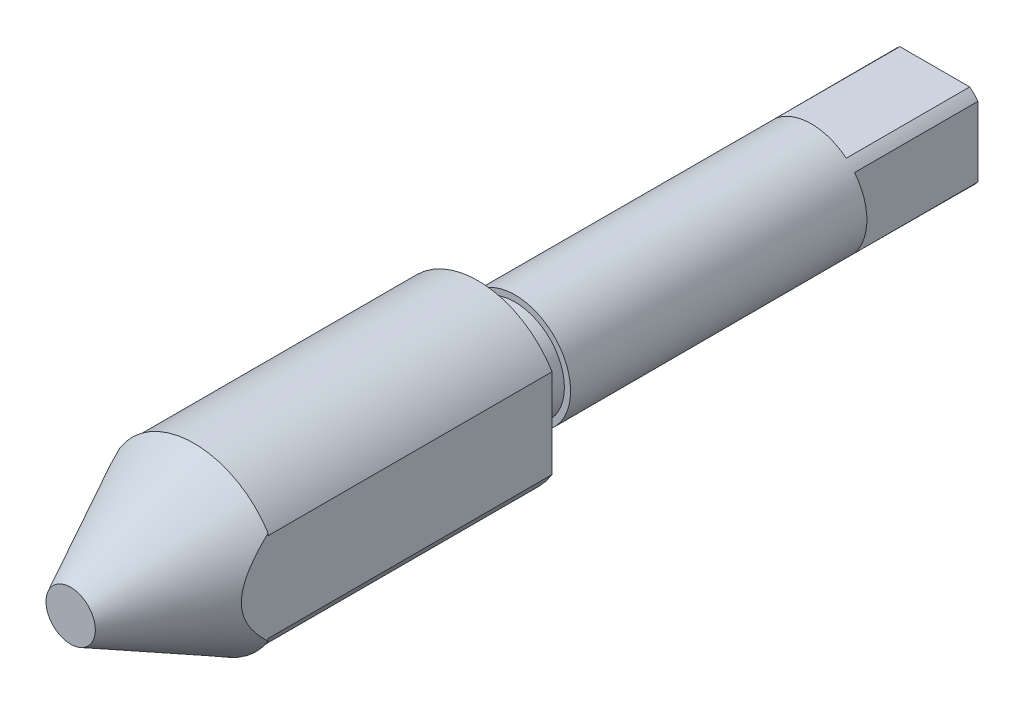
ISO-10303-21;
HEADER;
FILE_DESCRIPTION(('STEP AP214'),'2;1');
FILE_NAME('part.step','',(''),(''),'','','');
FILE_SCHEMA(('AUTOMOTIVE_DESIGN { 1 0 10303 214 1 1 1 1 }'));
ENDSEC;
DATA;
#1=APPLICATION_CONTEXT('core data for automotive mechanical design processes');
#2=APPLICATION_PROTOCOL_DEFINITION('international standard','automotive_design',2000,#1);
#3=PRODUCT_CONTEXT('',#1,'mechanical');
#4=PRODUCT('Part','Part','',(#3));
#5=PRODUCT_RELATED_PRODUCT_CATEGORY('part','',(#4));
#6=PRODUCT_DEFINITION_FORMATION('','',#4);
#7=PRODUCT_DEFINITION_CONTEXT('part definition',#1,'design');
#8=PRODUCT_DEFINITION('design','',#6,#7);
#9=PRODUCT_DEFINITION_SHAPE('','',#8);
#10=(LENGTH_UNIT() NAMED_UNIT(*) SI_UNIT(.MILLI.,.METRE.));
#11=(NAMED_UNIT(*) PLANE_ANGLE_UNIT() SI_UNIT($,.RADIAN.));
#12=(NAMED_UNIT(*) SI_UNIT($,.STERADIAN.) SOLID_ANGLE_UNIT());
#13=UNCERTAINTY_MEASURE_WITH_UNIT(LENGTH_MEASURE(1.E-05),#10,'distance_accuracy_value','');
#14=(GEOMETRIC_REPRESENTATION_CONTEXT(3) GLOBAL_UNCERTAINTY_ASSIGNED_CONTEXT((#13)) GLOBAL_UNIT_ASSIGNED_CONTEXT((#10,
#11,#12)) REPRESENTATION_CONTEXT('',''));
#15=CARTESIAN_POINT('',(0.,0.,0.));
#16=DIRECTION('',(0.,0.,1.));
#17=DIRECTION('',(1.,0.,0.));
#18=AXIS2_PLACEMENT_3D('',#15,#16,#17);
#19=CARTESIAN_POINT('',(0.,0.,34.));
#20=DIRECTION('',(0.,0.,-1.));
#21=DIRECTION('',(-1.,0.,0.));
#22=AXIS2_PLACEMENT_3D('',#19,#20,#21);
#23=CYLINDRICAL_SURFACE('',#22,4.5);
#24=CARTESIAN_POINT('',(0.,0.,34.));
#25=DIRECTION('',(0.,0.,1.));
#26=DIRECTION('',(1.,0.,0.));
#27=AXIS2_PLACEMENT_3D('',#24,#25,#26);
#28=CIRCLE('',#27,4.5);
#29=CARTESIAN_POINT('',(4.5,0.,34.));
#30=VERTEX_POINT('',#29);
#31=EDGE_CURVE('E181',#30,#30,#28,.T.);
#32=ORIENTED_EDGE('',*,*,#31,.F.);
#33=EDGE_LOOP('',(#32));
#34=FACE_BOUND('',#33,.T.);
#35=DIRECTION('',(0.,0.,-1.));
#36=VECTOR('',#35,1.);
#37=CARTESIAN_POINT('',(-3.5,2.82842712474619,34.));
#38=LINE('',#37,#36);
#39=CARTESIAN_POINT('',(-3.5,2.82842712474619,10.));
#40=VERTEX_POINT('',#39);
#41=CARTESIAN_POINT('',(-3.5,2.82842712474619,0.));
#42=VERTEX_POINT('',#41);
#43=EDGE_CURVE('E301',#40,#42,#38,.T.);
#44=ORIENTED_EDGE('',*,*,#43,.F.);
#45=CARTESIAN_POINT('',(0.,0.,10.));
#46=DIRECTION('',(0.,0.,-1.));
#47=DIRECTION('',(-1.,0.,0.));
#48=AXIS2_PLACEMENT_3D('',#45,#46,#47);
#49=CIRCLE('',#48,4.5);
#50=CARTESIAN_POINT('',(-3.5,-2.82842712474619,10.));
#51=VERTEX_POINT('',#50);
#52=EDGE_CURVE('E12',#51,#40,#49,.T.);
#53=ORIENTED_EDGE('',*,*,#52,.F.);
#54=DIRECTION('',(0.,0.,-1.));
#55=VECTOR('',#54,1.);
#56=CARTESIAN_POINT('',(-3.5,-2.82842712474619,34.));
#57=LINE('',#56,#55);
#58=CARTESIAN_POINT('',(-3.5,-2.82842712474619,0.));
#59=VERTEX_POINT('',#58);
#60=EDGE_CURVE('E304',#59,#51,#57,.F.);
#61=ORIENTED_EDGE('',*,*,#60,.F.);
#62=CARTESIAN_POINT('',(0.,0.,0.));
#63=DIRECTION('',(0.,0.,1.));
#64=DIRECTION('',(1.,0.,0.));
#65=AXIS2_PLACEMENT_3D('',#62,#63,#64);
#66=CIRCLE('',#65,4.5);
#67=CARTESIAN_POINT('',(-2.82842712474619,-3.5,0.));
#68=VERTEX_POINT('',#67);
#69=EDGE_CURVE('E177',#59,#68,#66,.T.);
#70=ORIENTED_EDGE('',*,*,#69,.T.);
#71=DIRECTION('',(0.,0.,-1.));
#72=VECTOR('',#71,1.);
#73=CARTESIAN_POINT('',(-2.82842712474619,-3.5,34.));
#74=LINE('',#73,#72);
#75=CARTESIAN_POINT('',(-2.82842712474619,-3.5,10.));
#76=VERTEX_POINT('',#75);
#77=EDGE_CURVE('E66',#76,#68,#74,.T.);
#78=ORIENTED_EDGE('',*,*,#77,.F.);
#79=CARTESIAN_POINT('',(2.82842712474619,-3.5,10.));
#80=VERTEX_POINT('',#79);
#81=EDGE_CURVE('E51',#80,#76,#49,.T.);
#82=ORIENTED_EDGE('',*,*,#81,.F.);
#83=DIRECTION('',(0.,0.,-1.));
#84=VECTOR('',#83,1.);
#85=CARTESIAN_POINT('',(2.82842712474619,-3.5,34.));
#86=LINE('',#85,#84);
#87=CARTESIAN_POINT('',(2.82842712474619,-3.5,0.));
#88=VERTEX_POINT('',#87);
#89=EDGE_CURVE('E309',#88,#80,#86,.F.);
#90=ORIENTED_EDGE('',*,*,#89,.F.);
#91=CARTESIAN_POINT('',(3.5,-2.82842712474619,0.));
#92=VERTEX_POINT('',#91);
#93=EDGE_CURVE('E182',#88,#92,#66,.T.);
#94=ORIENTED_EDGE('',*,*,#93,.T.);
#95=DIRECTION('',(0.,0.,-1.));
#96=VECTOR('',#95,1.);
#97=CARTESIAN_POINT('',(3.5,-2.82842712474619,34.));
#98=LINE('',#97,#96);
#99=CARTESIAN_POINT('',(3.5,-2.82842712474619,10.));
#100=VERTEX_POINT('',#99);
#101=EDGE_CURVE('E58',#100,#92,#98,.T.);
#102=ORIENTED_EDGE('',*,*,#101,.F.);
#103=CARTESIAN_POINT('',(3.5,2.82842712474619,10.));
#104=VERTEX_POINT('',#103);
#105=EDGE_CURVE('E367',#104,#100,#49,.T.);
#106=ORIENTED_EDGE('',*,*,#105,.F.);
#107=DIRECTION('',(0.,0.,-1.));
#108=VECTOR('',#107,1.);
#109=CARTESIAN_POINT('',(3.5,2.82842712474619,34.));
#110=LINE('',#109,#108);
#111=CARTESIAN_POINT('',(3.5,2.82842712474619,0.));
#112=VERTEX_POINT('',#111);
#113=EDGE_CURVE('E314',#112,#104,#110,.F.);
#114=ORIENTED_EDGE('',*,*,#113,.F.);
#115=CARTESIAN_POINT('',(2.82842712474619,3.5,0.));
#116=VERTEX_POINT('',#115);
#117=EDGE_CURVE('E176',#112,#116,#66,.T.);
#118=ORIENTED_EDGE('',*,*,#117,.T.);
#119=DIRECTION('',(0.,0.,-1.));
#120=VECTOR('',#119,1.);
#121=CARTESIAN_POINT('',(2.82842712474619,3.5,34.));
#122=LINE('',#121,#120);
#123=CARTESIAN_POINT('',(2.82842712474619,3.5,10.));
#124=VERTEX_POINT('',#123);
#125=EDGE_CURVE('E154',#124,#116,#122,.T.);
#126=ORIENTED_EDGE('',*,*,#125,.F.);
#127=CARTESIAN_POINT('',(-2.82842712474619,3.5,10.));
#128=VERTEX_POINT('',#127);
#129=EDGE_CURVE('E45',#128,#124,#49,.T.);
#130=ORIENTED_EDGE('',*,*,#129,.F.);
#131=DIRECTION('',(0.,0.,-1.));
#132=VECTOR('',#131,1.);
#133=CARTESIAN_POINT('',(-2.82842712474619,3.5,34.));
#134=LINE('',#133,#132);
#135=CARTESIAN_POINT('',(-2.82842712474619,3.5,0.));
#136=VERTEX_POINT('',#135);
#137=EDGE_CURVE('E151',#136,#128,#134,.F.);
#138=ORIENTED_EDGE('',*,*,#137,.F.);
#139=EDGE_CURVE('E167',#136,#42,#66,.T.);
#140=ORIENTED_EDGE('',*,*,#139,.T.);
#141=EDGE_LOOP('',(#44,#53,#61,#70,#78,#82,#90,#94,#102,#106,#114,#118,#126,#130,#138,#140));
#142=FACE_BOUND('',#141,.T.);
#143=ADVANCED_FACE('F42',(#34,#142),#23,.T.);
#144=CARTESIAN_POINT('',(0.,0.,0.));
#145=DIRECTION('',(0.,0.,1.));
#146=DIRECTION('',(1.,0.,0.));
#147=AXIS2_PLACEMENT_3D('',#144,#145,#146);
#148=PLANE('',#147);
#149=CARTESIAN_POINT('',(0.,0.,0.));
#150=DIRECTION('',(0.,0.,-1.));
#151=DIRECTION('',(-1.,0.,0.));
#152=AXIS2_PLACEMENT_3D('',#149,#150,#151);
#153=CIRCLE('',#152,2.59999999999999);
#154=CARTESIAN_POINT('',(-2.59999999999999,0.,0.));
#155=VERTEX_POINT('',#154);
#156=EDGE_CURVE('E297',#155,#155,#153,.T.);
#157=ORIENTED_EDGE('',*,*,#156,.F.);
#158=EDGE_LOOP('',(#157));
#159=FACE_BOUND('',#158,.T.);
#160=DIRECTION('',(0.,-1.,0.));
#161=VECTOR('',#160,1.);
#162=CARTESIAN_POINT('',(-3.5,0.,0.));
#163=LINE('',#162,#161);
#164=EDGE_CURVE('E174',#42,#59,#163,.T.);
#165=ORIENTED_EDGE('',*,*,#164,.F.);
#166=ORIENTED_EDGE('',*,*,#139,.F.);
#167=DIRECTION('',(-1.,0.,0.));
#168=VECTOR('',#167,1.);
#169=CARTESIAN_POINT('',(0.,3.5,0.));
#170=LINE('',#169,#168);
#171=EDGE_CURVE('E147',#116,#136,#170,.T.);
#172=ORIENTED_EDGE('',*,*,#171,.F.);
#173=ORIENTED_EDGE('',*,*,#117,.F.);
#174=DIRECTION('',(0.,1.,0.));
#175=VECTOR('',#174,1.);
#176=CARTESIAN_POINT('',(3.5,0.,0.));
#177=LINE('',#176,#175);
#178=EDGE_CURVE('E160',#92,#112,#177,.T.);
#179=ORIENTED_EDGE('',*,*,#178,.F.);
#180=ORIENTED_EDGE('',*,*,#93,.F.);
#181=DIRECTION('',(1.,0.,0.));
#182=VECTOR('',#181,1.);
#183=CARTESIAN_POINT('',(0.,-3.5,0.));
#184=LINE('',#183,#182);
#185=EDGE_CURVE('E412',#68,#88,#184,.T.);
#186=ORIENTED_EDGE('',*,*,#185,.F.);
#187=ORIENTED_EDGE('',*,*,#69,.F.);
#188=EDGE_LOOP('',(#165,#166,#172,#173,#179,#180,#186,#187));
#189=FACE_BOUND('',#188,.T.);
#190=ADVANCED_FACE('F172',(#159,#189),#148,.F.);
#191=CARTESIAN_POINT('',(0.,0.,60.));
#192=DIRECTION('',(0.,0.,-1.));
#193=DIRECTION('',(-1.,0.,0.));
#194=AXIS2_PLACEMENT_3D('',#191,#192,#193);
#195=PLANE('',#194);
#196=DIRECTION('',(0.,1.,0.));
#197=VECTOR('',#196,1.);
#198=CARTESIAN_POINT('',(6.,-4.38988199607593,60.));
#199=LINE('',#198,#197);
#200=CARTESIAN_POINT('',(6.,-3.80284186564216,60.));
#201=VERTEX_POINT('',#200);
#202=CARTESIAN_POINT('',(6.,-3.60555127546399,60.));
#203=VERTEX_POINT('',#202);
#204=EDGE_CURVE('E285',#201,#203,#199,.T.);
#205=ORIENTED_EDGE('',*,*,#204,.F.);
#206=CARTESIAN_POINT('',(0.00751481048411051,-0.00379493233637618,60.));
#207=DIRECTION('',(0.,0.,-1.));
#208=DIRECTION('',(-1.,0.,0.));
#209=AXIS2_PLACEMENT_3D('',#206,#207,#208);
#210=CIRCLE('',#209,7.0952544949443);
#211=CARTESIAN_POINT('',(-6.,-3.77903030908328,60.));
#212=VERTEX_POINT('',#211);
#213=EDGE_CURVE('E273',#212,#201,#210,.F.);
#214=ORIENTED_EDGE('',*,*,#213,.F.);
#215=DIRECTION('',(0.,-1.,0.));
#216=VECTOR('',#215,1.);
#217=CARTESIAN_POINT('',(-6.,4.23649426276995,60.));
#218=LINE('',#217,#216);
#219=CARTESIAN_POINT('',(-6.,-3.60555127546399,60.));
#220=VERTEX_POINT('',#219);
#221=EDGE_CURVE('E286',#220,#212,#218,.T.);
#222=ORIENTED_EDGE('',*,*,#221,.F.);
#223=CARTESIAN_POINT('',(0.,0.,60.));
#224=DIRECTION('',(0.,0.,1.));
#225=DIRECTION('',(1.,0.,0.));
#226=AXIS2_PLACEMENT_3D('',#223,#224,#225);
#227=CIRCLE('',#226,7.);
#228=EDGE_CURVE('E261',#220,#203,#227,.T.);
#229=ORIENTED_EDGE('',*,*,#228,.T.);
#230=EDGE_LOOP('',(#205,#214,#222,#229));
#231=FACE_BOUND('',#230,.T.);
#232=ADVANCED_FACE('F216',(#231),#195,.T.);
#233=CARTESIAN_POINT('',(0.,0.,34.));
#234=DIRECTION('',(0.,0.,1.));
#235=DIRECTION('',(1.,0.,0.));
#236=AXIS2_PLACEMENT_3D('',#233,#234,#235);
#237=PLANE('',#236);
#238=CARTESIAN_POINT('',(0.,0.,34.));
#239=DIRECTION('',(0.,0.,1.));
#240=DIRECTION('',(1.,0.,0.));
#241=AXIS2_PLACEMENT_3D('',#238,#239,#240);
#242=CIRCLE('',#241,4.);
#243=CARTESIAN_POINT('',(4.,0.,34.));
#244=VERTEX_POINT('',#243);
#245=EDGE_CURVE('E197',#244,#244,#242,.T.);
#246=ORIENTED_EDGE('',*,*,#245,.F.);
#247=EDGE_LOOP('',(#246));
#248=FACE_BOUND('',#247,.T.);
#249=ORIENTED_EDGE('',*,*,#31,.T.);
#250=EDGE_LOOP('',(#249));
#251=FACE_BOUND('',#250,.T.);
#252=ADVANCED_FACE('F420',(#248,#251),#237,.T.);
#253=CARTESIAN_POINT('',(0.,0.,37.));
#254=DIRECTION('',(0.,0.,-1.));
#255=DIRECTION('',(-1.,0.,0.));
#256=AXIS2_PLACEMENT_3D('',#253,#254,#255);
#257=CYLINDRICAL_SURFACE('',#256,4.);
#258=CARTESIAN_POINT('',(0.,0.,37.));
#259=DIRECTION('',(0.,0.,1.));
#260=DIRECTION('',(1.,0.,0.));
#261=AXIS2_PLACEMENT_3D('',#258,#259,#260);
#262=CIRCLE('',#261,4.);
#263=CARTESIAN_POINT('',(4.,0.,37.));
#264=VERTEX_POINT('',#263);
#265=EDGE_CURVE('E243',#264,#264,#262,.T.);
#266=ORIENTED_EDGE('',*,*,#265,.F.);
#267=EDGE_LOOP('',(#266));
#268=FACE_BOUND('',#267,.T.);
#269=ORIENTED_EDGE('',*,*,#245,.T.);
#270=EDGE_LOOP('',(#269));
#271=FACE_BOUND('',#270,.T.);
#272=ADVANCED_FACE('F424',(#268,#271),#257,.T.);
#273=CARTESIAN_POINT('',(6.,0.,60.));
#274=DIRECTION('',(1.,0.,0.));
#275=DIRECTION('',(0.,1.,0.));
#276=AXIS2_PLACEMENT_3D('',#273,#274,#275);
#277=PLANE('',#276);
#278=DIRECTION('',(0.,-1.,0.));
#279=VECTOR('',#278,1.);
#280=CARTESIAN_POINT('',(6.,0.,37.));
#281=LINE('',#280,#279);
#282=CARTESIAN_POINT('',(6.,3.60555127546399,37.));
#283=VERTEX_POINT('',#282);
#284=CARTESIAN_POINT('',(6.,-3.60555127546399,37.));
#285=VERTEX_POINT('',#284);
#286=EDGE_CURVE('E269',#283,#285,#281,.T.);
#287=ORIENTED_EDGE('',*,*,#286,.F.);
#288=DIRECTION('',(0.,0.,-1.));
#289=VECTOR('',#288,1.);
#290=CARTESIAN_POINT('',(6.,3.60555127546399,60.));
#291=LINE('',#290,#289);
#292=CARTESIAN_POINT('',(6.,3.60555127546399,60.));
#293=VERTEX_POINT('',#292);
#294=EDGE_CURVE('E247',#293,#283,#291,.T.);
#295=ORIENTED_EDGE('',*,*,#294,.F.);
#296=CARTESIAN_POINT('',(6.,3.79525200096941,60.));
#297=VERTEX_POINT('',#296);
#298=EDGE_CURVE('E291',#293,#297,#199,.T.);
#299=ORIENTED_EDGE('',*,*,#298,.T.);
#300=CARTESIAN_POINT('',(6.,-10.9691739825954,49.4004872156788));
#301=CARTESIAN_POINT('',(6.,-10.7891847394175,49.7104461312767));
#302=CARTESIAN_POINT('',(6.,-10.6084503408944,50.0199745408611));
#303=CARTESIAN_POINT('',(6.,-10.2452199763608,50.6380058338985));
#304=CARTESIAN_POINT('',(6.,-10.0627239675194,50.9465086921702));
#305=CARTESIAN_POINT('',(6.,-9.69558503173249,51.5625153529883));
#306=CARTESIAN_POINT('',(6.,-9.51094074939515,51.8700183485124));
#307=CARTESIAN_POINT('',(6.,-9.13928231430738,52.4835865473714));
#308=CARTESIAN_POINT('',(6.,-8.95226818199313,52.7896517630738));
#309=CARTESIAN_POINT('',(6.,-8.57567507492354,53.3996818514658));
#310=CARTESIAN_POINT('',(6.,-8.38609954157187,53.7036488461849));
#311=CARTESIAN_POINT('',(6.,-8.0036237677111,54.309483064009));
#312=CARTESIAN_POINT('',(6.,-7.81072356059647,54.6113503081622));
#313=CARTESIAN_POINT('',(6.,-7.42095686766889,55.2124078700438));
#314=CARTESIAN_POINT('',(6.,-7.22409140845207,55.5115988524054));
#315=CARTESIAN_POINT('',(6.,-6.82545575270739,56.1066888427346));
#316=CARTESIAN_POINT('',(6.,-6.62368576533942,56.402587990305));
#317=CARTESIAN_POINT('',(6.,-6.27714779187757,56.8995887361784));
#318=CARTESIAN_POINT('',(6.,-6.13397575671989,57.101802384589));
#319=CARTESIAN_POINT('',(6.,-5.84416804052487,57.5037511410697));
#320=CARTESIAN_POINT('',(6.,-5.69753221466432,57.7034861449716));
#321=CARTESIAN_POINT('',(6.,-5.39983581875309,58.1003030170531));
#322=CARTESIAN_POINT('',(6.,-5.24876651249645,58.2973783492808));
#323=CARTESIAN_POINT('',(6.,-4.94167443075701,58.6876222399044));
#324=CARTESIAN_POINT('',(6.,-4.7856520139013,58.8807910794974));
#325=CARTESIAN_POINT('',(6.,-4.46475416398191,59.2654801363672));
#326=CARTESIAN_POINT('',(6.,-4.29977103567946,59.4569109675617));
#327=CARTESIAN_POINT('',(6.,-3.96199397944048,59.8329339167261));
#328=CARTESIAN_POINT('',(6.,-3.7891971520888,60.0175234491024));
#329=CARTESIAN_POINT('',(6.,-3.4343326136412,60.3767549037611));
#330=CARTESIAN_POINT('',(6.,-3.25228881199187,60.5514202313352));
#331=CARTESIAN_POINT('',(6.,-2.87618400563064,60.8871605099637));
#332=CARTESIAN_POINT('',(6.,-2.68213454443038,61.0482481744224));
#333=CARTESIAN_POINT('',(6.,-2.3002546192268,61.3345151882532));
#334=CARTESIAN_POINT('',(6.,-2.11394519934512,61.4616908339021));
#335=CARTESIAN_POINT('',(6.,-1.72728116204307,61.6928804703171));
#336=CARTESIAN_POINT('',(6.,-1.52693812950627,61.7969132762284));
#337=CARTESIAN_POINT('',(6.,-1.1433053939511,61.9582814406596));
#338=CARTESIAN_POINT('',(6.,-0.96206537422568,62.0203157119845));
#339=CARTESIAN_POINT('',(6.,-0.684498505362249,62.0900491202554));
#340=CARTESIAN_POINT('',(6.,-0.591048563374087,62.1094053764438));
#341=CARTESIAN_POINT('',(6.,-0.402810165916026,62.1396973876835));
#342=CARTESIAN_POINT('',(6.,-0.308022337236438,62.1506369607297));
#343=CARTESIAN_POINT('',(6.,-0.117223575210965,62.1636981376465));
#344=CARTESIAN_POINT('',(6.,-0.0212086962744874,62.1657625374178));
#345=CARTESIAN_POINT('',(6.,0.17058390843039,62.160833484299));
#346=CARTESIAN_POINT('',(6.,0.26636163653473,62.1538401209865));
#347=CARTESIAN_POINT('',(6.,0.456887052091381,62.1310806320479));
#348=CARTESIAN_POINT('',(6.,0.551634477206833,62.1153123231014));
#349=CARTESIAN_POINT('',(6.,0.739425803903795,62.0756173016773));
#350=CARTESIAN_POINT('',(6.,0.832468620965285,62.0516855731968));
#351=CARTESIAN_POINT('',(6.,1.15977613324422,61.9533274144233));
#352=CARTESIAN_POINT('',(6.,1.3880473633721,61.8583485271788));
#353=CARTESIAN_POINT('',(6.,1.71709917680083,61.6907463178169));
#354=CARTESIAN_POINT('',(6.,1.82476306541875,61.6305413488152));
#355=CARTESIAN_POINT('',(6.,2.03595521161754,61.5032135470559));
#356=CARTESIAN_POINT('',(6.,2.13948399173332,61.4360915922284));
#357=CARTESIAN_POINT('',(6.,2.37577276409031,61.2734190766697));
#358=CARTESIAN_POINT('',(6.,2.50705225487348,61.1757371501278));
#359=CARTESIAN_POINT('',(6.,2.76363680591266,60.9727677660001));
#360=CARTESIAN_POINT('',(6.,2.88893901621561,60.8674767394112));
#361=CARTESIAN_POINT('',(6.,3.13452855849471,60.6508190840832));
#362=CARTESIAN_POINT('',(6.,3.25480684655986,60.5394422668542));
#363=CARTESIAN_POINT('',(6.,3.4908624800746,60.3120107549548));
#364=CARTESIAN_POINT('',(6.,3.60663924647695,60.1959554623601));
#365=CARTESIAN_POINT('',(6.,3.83560362303025,59.9587545039216));
#366=CARTESIAN_POINT('',(6.,3.9487464769573,59.8375658001495));
#367=CARTESIAN_POINT('',(6.,4.17160010434955,59.5920759861062));
#368=CARTESIAN_POINT('',(6.,4.28131077153251,59.4677747796664));
#369=CARTESIAN_POINT('',(6.,4.49762858277098,59.2167556203116));
#370=CARTESIAN_POINT('',(6.,4.60423914802649,59.0900406084282));
#371=CARTESIAN_POINT('',(6.,4.8148648471464,58.8344798641208));
#372=CARTESIAN_POINT('',(6.,4.91888001969755,58.7056341635044));
#373=CARTESIAN_POINT('',(6.,5.16832868998603,58.3910494402867));
#374=CARTESIAN_POINT('',(6.,5.31259420728949,58.2043845066312));
#375=CARTESIAN_POINT('',(6.,5.59726979993839,57.8281330728253));
#376=CARTESIAN_POINT('',(6.,5.73767965977496,57.6385464102882));
#377=CARTESIAN_POINT('',(6.,6.1540947121733,57.0661772997698));
#378=CARTESIAN_POINT('',(6.,6.42523243514229,56.679853529484));
#379=CARTESIAN_POINT('',(6.,6.95836981591578,55.9001492092222));
#380=CARTESIAN_POINT('',(6.,7.22035505201055,55.506758881402));
#381=CARTESIAN_POINT('',(6.,7.73705872617561,54.7152213812936));
#382=CARTESIAN_POINT('',(6.,7.99177684832847,54.3170740032702));
#383=CARTESIAN_POINT('',(6.,8.47815052813808,53.5448247952074));
#384=CARTESIAN_POINT('',(6.,8.71018429660355,53.1709604066947));
#385=CARTESIAN_POINT('',(6.,9.17028054354467,52.420780442975));
#386=CARTESIAN_POINT('',(6.,9.39834287827309,52.0444647797181));
#387=CARTESIAN_POINT('',(6.,9.85047828378287,51.291094623026));
#388=CARTESIAN_POINT('',(6.,10.0745618332261,50.9140464077479));
#389=CARTESIAN_POINT('',(6.,10.5199918763114,50.1583725335724));
#390=CARTESIAN_POINT('',(6.,10.7413385664393,49.7797469905552));
#391=CARTESIAN_POINT('',(6.,10.9615841179227,49.4004872156788));
#392=B_SPLINE_CURVE_WITH_KNOTS('',3,(#300,#301,#302,#303,#304,#305,#306,#307,#308,#309,#310,
#311,#312,#313,#314,#315,#316,#317,#318,#319,#320,#321,#322,#323,#324,#325,#326,#327,#328,#329,
#330,#331,#332,#333,#334,#335,#336,#337,#338,#339,#340,#341,#342,#343,#344,#345,#346,#347,#348,
#349,#350,#351,#352,#353,#354,#355,#356,#357,#358,#359,#360,#361,#362,#363,#364,#365,#366,#367,
#368,#369,#370,#371,#372,#373,#374,#375,#376,#377,#378,#379,#380,#381,#382,#383,#384,#385,#386,
#387,#388,#389,#390,#391),.UNSPECIFIED.,.F.,.F.,(4,2,2,2,2,2,2,2,2,2,2,2,2,2,2,2,2,2,2,2,2,2,2,
2,2,2,2,2,2,2,2,2,2,2,2,2,2,2,2,2,2,2,2,2,2,4),(0.,1.07528590336738,2.15059801684923,
3.22662995596558,4.30265262232916,5.37735045983451,6.45203750888816,7.52644981165836,
8.60081637484971,9.34408878451088,10.0873923260462,10.8322745619235,11.5771029874924,
12.3350874361081,13.0933554944817,13.8497539152945,14.6054360291387,15.2810176117775,
15.9560479223342,16.5282727954787,16.8142457696009,17.1000889434032,17.387771756321,
17.6754517241937,17.9632033026027,18.2511320090472,18.9879794198847,19.3579147587862,
19.7278032017784,20.2183453341373,20.7091190647115,21.2007412172056,21.6924264010384,
22.1897349758795,22.6870589353287,23.1838114534912,23.6805565626649,24.3882388020719,
25.0959605166264,26.5116618593493,27.9295016234579,29.347402930551,30.6674229638521,
31.9874906767742,33.3033088852613,34.6190320728899),.UNSPECIFIED.);
#393=EDGE_CURVE('E161',#201,#297,#392,.T.);
#394=ORIENTED_EDGE('',*,*,#393,.F.);
#395=ORIENTED_EDGE('',*,*,#204,.T.);
#396=DIRECTION('',(0.,0.,-1.));
#397=VECTOR('',#396,1.);
#398=CARTESIAN_POINT('',(6.,-3.60555127546399,60.));
#399=LINE('',#398,#397);
#400=EDGE_CURVE('E258',#203,#285,#399,.T.);
#401=ORIENTED_EDGE('',*,*,#400,.T.);
#402=EDGE_LOOP('',(#287,#295,#299,#394,#395,#401));
#403=FACE_BOUND('',#402,.T.);
#404=ADVANCED_FACE('F397',(#403),#277,.T.);
#405=CARTESIAN_POINT('',(0.,0.,60.));
#406=DIRECTION('',(0.,0.,-1.));
#407=DIRECTION('',(-1.,0.,0.));
#408=AXIS2_PLACEMENT_3D('',#405,#406,#407);
#409=CYLINDRICAL_SURFACE('',#408,7.);
#410=CARTESIAN_POINT('',(0.,0.,37.));
#411=DIRECTION('',(0.,0.,1.));
#412=DIRECTION('',(1.,0.,0.));
#413=AXIS2_PLACEMENT_3D('',#410,#411,#412);
#414=CIRCLE('',#413,7.);
#415=CARTESIAN_POINT('',(-6.,3.60555127546399,37.));
#416=VERTEX_POINT('',#415);
#417=EDGE_CURVE('E266',#283,#416,#414,.T.);
#418=ORIENTED_EDGE('',*,*,#417,.T.);
#419=DIRECTION('',(0.,0.,-1.));
#420=VECTOR('',#419,1.);
#421=CARTESIAN_POINT('',(-6.,3.60555127546399,60.));
#422=LINE('',#421,#420);
#423=CARTESIAN_POINT('',(-6.,3.60555127546399,60.));
#424=VERTEX_POINT('',#423);
#425=EDGE_CURVE('E250',#424,#416,#422,.T.);
#426=ORIENTED_EDGE('',*,*,#425,.F.);
#427=EDGE_CURVE('E274',#293,#424,#227,.T.);
#428=ORIENTED_EDGE('',*,*,#427,.F.);
#429=ORIENTED_EDGE('',*,*,#294,.T.);
#430=EDGE_LOOP('',(#418,#426,#428,#429));
#431=FACE_BOUND('',#430,.T.);
#432=ADVANCED_FACE('F391',(#431),#409,.T.);
#433=CARTESIAN_POINT('',(-6.,0.,60.));
#434=DIRECTION('',(1.,0.,0.));
#435=DIRECTION('',(0.,1.,0.));
#436=AXIS2_PLACEMENT_3D('',#433,#434,#435);
#437=PLANE('',#436);
#438=DIRECTION('',(0.,-1.,0.));
#439=VECTOR('',#438,1.);
#440=CARTESIAN_POINT('',(-6.,0.,37.));
#441=LINE('',#440,#439);
#442=CARTESIAN_POINT('',(-6.,-3.60555127546399,37.));
#443=VERTEX_POINT('',#442);
#444=EDGE_CURVE('E262',#416,#443,#441,.T.);
#445=ORIENTED_EDGE('',*,*,#444,.T.);
#446=DIRECTION('',(0.,0.,-1.));
#447=VECTOR('',#446,1.);
#448=CARTESIAN_POINT('',(-6.,-3.60555127546399,60.));
#449=LINE('',#448,#447);
#450=EDGE_CURVE('E254',#220,#443,#449,.T.);
#451=ORIENTED_EDGE('',*,*,#450,.F.);
#452=ORIENTED_EDGE('',*,*,#221,.T.);
#453=CARTESIAN_POINT('',(-6.,11.5052834191867,48.4453419541586));
#454=CARTESIAN_POINT('',(-6.,11.2470128816902,48.8946115110041));
#455=CARTESIAN_POINT('',(-6.,10.9874076417658,49.3431219037309));
#456=CARTESIAN_POINT('',(-6.,10.4647524127477,50.2382003513881));
#457=CARTESIAN_POINT('',(-6.,10.2017020229711,50.6847681721986));
#458=CARTESIAN_POINT('',(-6.,9.67004032401316,51.5777851739319));
#459=CARTESIAN_POINT('',(-6.,9.40140697393772,52.0242212568239));
#460=CARTESIAN_POINT('',(-6.,8.85886995833365,52.9138466753589));
#461=CARTESIAN_POINT('',(-6.,8.58496664372357,53.3570362244886));
#462=CARTESIAN_POINT('',(-6.,8.03031568759564,54.2392731407429));
#463=CARTESIAN_POINT('',(-6.,7.74956637292013,54.6783194581523));
#464=CARTESIAN_POINT('',(-6.,7.17911261401372,55.5507136532615));
#465=CARTESIAN_POINT('',(-6.,6.88940650466916,55.9840604497867));
#466=CARTESIAN_POINT('',(-6.,6.44613848025481,56.6272722072216));
#467=CARTESIAN_POINT('',(-6.,6.29712727015881,56.8402730875966));
#468=CARTESIAN_POINT('',(-6.,5.99552277956684,57.2637196891923));
#469=CARTESIAN_POINT('',(-6.,5.84292962049402,57.4741654966606));
#470=CARTESIAN_POINT('',(-6.,5.53351619436464,57.8918291689709));
#471=CARTESIAN_POINT('',(-6.,5.37669729388125,58.0990480439698));
#472=CARTESIAN_POINT('',(-6.,5.05790716701131,58.5094728088354));
#473=CARTESIAN_POINT('',(-6.,4.89593644266385,58.7126790866159));
#474=CARTESIAN_POINT('',(-6.,4.61956063495543,59.0484212921923));
#475=CARTESIAN_POINT('',(-6.,4.50688295474383,59.1823782825981));
#476=CARTESIAN_POINT('',(-6.,4.27819828239508,59.4474360434042));
#477=CARTESIAN_POINT('',(-6.,4.16219118916082,59.5785367268601));
#478=CARTESIAN_POINT('',(-6.,3.92605670889552,59.8375106979801));
#479=CARTESIAN_POINT('',(-6.,3.80592088129821,59.965376316747));
#480=CARTESIAN_POINT('',(-6.,3.56111986147304,60.2167041952067));
#481=CARTESIAN_POINT('',(-6.,3.43645488256007,60.3401666617387));
#482=CARTESIAN_POINT('',(-6.,3.18067538900249,60.5825831486754));
#483=CARTESIAN_POINT('',(-6.,3.04951348965088,60.7014874883091));
#484=CARTESIAN_POINT('',(-6.,2.78078945859849,60.931979876368));
#485=CARTESIAN_POINT('',(-6.,2.64322523811264,61.0435655080184));
#486=CARTESIAN_POINT('',(-6.,2.36104769498178,61.2567550343865));
#487=CARTESIAN_POINT('',(-6.,2.2164539335766,61.3583844945362));
#488=CARTESIAN_POINT('',(-6.,1.91907007967907,61.5486500600726));
#489=CARTESIAN_POINT('',(-6.,1.76628779386104,61.6372982506472));
#490=CARTESIAN_POINT('',(-6.,1.43592726622961,61.805371616718));
#491=CARTESIAN_POINT('',(-6.,1.25739577710848,61.8829949497081));
#492=CARTESIAN_POINT('',(-6.,0.98244223324261,61.9782972955869));
#493=CARTESIAN_POINT('',(-6.,0.889639914845715,62.0065350030082));
#494=CARTESIAN_POINT('',(-6.,0.702009611834927,62.0551162209567));
#495=CARTESIAN_POINT('',(-6.,0.607182663362804,62.0754636719243));
#496=CARTESIAN_POINT('',(-6.,0.41504732550411,62.1076968364376));
#497=CARTESIAN_POINT('',(-6.,0.317723256886529,62.119489981652));
#498=CARTESIAN_POINT('',(-6.,0.122391867099177,62.1337638155997));
#499=CARTESIAN_POINT('',(-6.,0.0243845844353487,62.1362450249699));
#500=CARTESIAN_POINT('',(-6.,-0.17145519213724,62.1317847520732));
#501=CARTESIAN_POINT('',(-6.,-0.269287594355102,62.1248392755603));
#502=CARTESIAN_POINT('',(-6.,-0.463868634484223,62.1018219713449));
#503=CARTESIAN_POINT('',(-6.,-0.56061714222851,62.0857490592413));
#504=CARTESIAN_POINT('',(-6.,-0.764343936553162,62.0425636040888));
#505=CARTESIAN_POINT('',(-6.,-0.871081437456393,62.0143183363363));
#506=CARTESIAN_POINT('',(-6.,-1.08159711018107,61.9482990469399));
#507=CARTESIAN_POINT('',(-6.,-1.18537311634426,61.9105182414008));
#508=CARTESIAN_POINT('',(-6.,-1.49189358680067,61.78481323763));
#509=CARTESIAN_POINT('',(-6.,-1.68961521305854,61.6845769020945));
#510=CARTESIAN_POINT('',(-6.,-2.05664701080991,61.4698269070968));
#511=CARTESIAN_POINT('',(-6.,-2.22697423086427,61.356980516846));
#512=CARTESIAN_POINT('',(-6.,-2.55759195180888,61.1172461879438));
#513=CARTESIAN_POINT('',(-6.,-2.71787237936504,60.9903444986638));
#514=CARTESIAN_POINT('',(-6.,-3.03034626399031,60.7259834539354));
#515=CARTESIAN_POINT('',(-6.,-3.18250907293195,60.5884883023945));
#516=CARTESIAN_POINT('',(-6.,-3.40528861300709,60.3766396517224));
#517=CARTESIAN_POINT('',(-6.,-3.47862175511779,60.3051058815355));
#518=CARTESIAN_POINT('',(-6.,-3.62364157263576,60.1603904077865));
#519=CARTESIAN_POINT('',(-6.,-3.69532828327262,60.0872087395518));
#520=CARTESIAN_POINT('',(-6.,-3.92206516952419,59.8510176113284));
#521=CARTESIAN_POINT('',(-6.,-4.07426359846577,59.6852665604131));
#522=CARTESIAN_POINT('',(-6.,-4.37276928122208,59.3485232212006));
#523=CARTESIAN_POINT('',(-6.,-4.51907531366949,59.1775298590898));
#524=CARTESIAN_POINT('',(-6.,-4.80688120152578,58.831363354156));
#525=CARTESIAN_POINT('',(-6.,-4.94837777636115,58.656187491779));
#526=CARTESIAN_POINT('',(-6.,-5.22727065004708,58.3025936199136));
#527=CARTESIAN_POINT('',(-6.,-5.36466667532798,58.1241753953817));
#528=CARTESIAN_POINT('',(-6.,-5.63633470422712,57.7642622252617));
#529=CARTESIAN_POINT('',(-6.,-5.77059778219394,57.5827605568975));
#530=CARTESIAN_POINT('',(-6.,-6.03614673951428,57.2175893394563));
#531=CARTESIAN_POINT('',(-6.,-6.16743253333712,57.033919728329));
#532=CARTESIAN_POINT('',(-6.,-6.55735861822739,56.4803739173878));
#533=CARTESIAN_POINT('',(-6.,-6.81218157281593,56.1078080881402));
#534=CARTESIAN_POINT('',(-6.,-7.31489742871268,55.3564009436861));
#535=CARTESIAN_POINT('',(-6.,-7.56276657808426,54.9775438389656));
#536=CARTESIAN_POINT('',(-6.,-8.05249666883095,54.215927198615));
#537=CARTESIAN_POINT('',(-6.,-8.2943570843797,53.8331673255573));
#538=CARTESIAN_POINT('',(-6.,-8.77296291764938,53.0651912006413));
#539=CARTESIAN_POINT('',(-6.,-9.0097148318692,52.6799789875652));
#540=CARTESIAN_POINT('',(-6.,-9.47935527532476,51.9072062244427));
#541=CARTESIAN_POINT('',(-6.,-9.71224377987051,51.5196456594103));
#542=CARTESIAN_POINT('',(-6.,-10.0764117193158,50.9079632362081));
#543=CARTESIAN_POINT('',(-6.,-10.2087565555779,50.684474303722));
#544=CARTESIAN_POINT('',(-6.,-10.4725284789606,50.2368926705919));
#545=CARTESIAN_POINT('',(-6.,-10.6039553691709,50.0127998538793));
#546=CARTESIAN_POINT('',(-6.,-10.8654163504093,49.5650427280194));
#547=CARTESIAN_POINT('',(-6.,-10.9954539510244,49.3413804671275));
#548=CARTESIAN_POINT('',(-6.,-11.2547337425467,48.8936587410935));
#549=CARTESIAN_POINT('',(-6.,-11.3839760964933,48.6695993703816));
#550=CARTESIAN_POINT('',(-6.,-11.5128732838596,48.4453419541586));
#551=B_SPLINE_CURVE_WITH_KNOTS('',3,(#453,#454,#455,#456,#457,#458,#459,#460,#461,#462,#463,
#464,#465,#466,#467,#468,#469,#470,#471,#472,#473,#474,#475,#476,#477,#478,#479,#480,#481,#482,
#483,#484,#485,#486,#487,#488,#489,#490,#491,#492,#493,#494,#495,#496,#497,#498,#499,#500,#501,
#502,#503,#504,#505,#506,#507,#508,#509,#510,#511,#512,#513,#514,#515,#516,#517,#518,#519,#520,
#521,#522,#523,#524,#525,#526,#527,#528,#529,#530,#531,#532,#533,#534,#535,#536,#537,#538,#539,
#540,#541,#542,#543,#544,#545,#546,#547,#548,#549,#550),.UNSPECIFIED.,.F.,.F.,(4,2,2,2,2,2,2,2,
2,2,2,2,2,2,2,2,2,2,2,2,2,2,2,2,2,2,2,2,2,2,2,2,2,2,2,2,2,2,2,2,2,2,2,2,2,2,2,2,4),(0.,
1.55465335580778,3.10948915779057,4.67254157060363,6.23549026000997,7.79882483920377,
9.36245181883323,10.1422715587963,10.9220649020075,11.7016090227345,12.4810774091633,
13.0061680593594,13.5312746707556,14.0575274148549,14.5837554054449,15.1146492478588,
15.6457175278068,16.1753842763636,16.7045547419873,17.286505865395,17.5772306653024,
17.8678100879775,18.1614888517358,18.4551511954637,18.7489380077391,19.0427597311817,
19.3734730029587,19.7044222215201,20.3669755971744,20.9791024874473,21.591833615697,
22.2067345883064,22.5140464676711,22.8213517651812,23.4962382531629,24.1712639181301,
24.8467411429057,25.5222633321067,26.1995197487411,26.8767955968423,28.2307760214405,
29.5889251159221,30.947192646808,32.3036167587065,33.6600495358013,34.4392536607481,
35.2186200945327,35.9947701222717,36.7707553369173),.UNSPECIFIED.);
#552=CARTESIAN_POINT('',(-6.,3.77144044441053,60.));
#553=VERTEX_POINT('',#552);
#554=EDGE_CURVE('E187',#553,#212,#551,.T.);
#555=ORIENTED_EDGE('',*,*,#554,.F.);
#556=EDGE_CURVE('E289',#553,#424,#218,.T.);
#557=ORIENTED_EDGE('',*,*,#556,.T.);
#558=ORIENTED_EDGE('',*,*,#425,.T.);
#559=EDGE_LOOP('',(#445,#451,#452,#555,#557,#558));
#560=FACE_BOUND('',#559,.T.);
#561=ADVANCED_FACE('F386',(#560),#437,.F.);
#562=EDGE_CURVE('E265',#443,#285,#414,.T.);
#563=ORIENTED_EDGE('',*,*,#562,.T.);
#564=ORIENTED_EDGE('',*,*,#400,.F.);
#565=ORIENTED_EDGE('',*,*,#228,.F.);
#566=ORIENTED_EDGE('',*,*,#450,.T.);
#567=EDGE_LOOP('',(#563,#564,#565,#566));
#568=FACE_BOUND('',#567,.T.);
#569=ADVANCED_FACE('F403',(#568),#409,.T.);
#570=CARTESIAN_POINT('',(0.,0.,37.));
#571=DIRECTION('',(0.,0.,1.));
#572=DIRECTION('',(1.,0.,0.));
#573=AXIS2_PLACEMENT_3D('',#570,#571,#572);
#574=PLANE('',#573);
#575=ORIENTED_EDGE('',*,*,#265,.T.);
#576=EDGE_LOOP('',(#575));
#577=FACE_BOUND('',#576,.T.);
#578=ORIENTED_EDGE('',*,*,#286,.T.);
#579=ORIENTED_EDGE('',*,*,#562,.F.);
#580=ORIENTED_EDGE('',*,*,#444,.F.);
#581=ORIENTED_EDGE('',*,*,#417,.F.);
#582=EDGE_LOOP('',(#578,#579,#580,#581));
#583=FACE_BOUND('',#582,.T.);
#584=ADVANCED_FACE('F214',(#577,#583),#574,.F.);
#585=ORIENTED_EDGE('',*,*,#298,.F.);
#586=ORIENTED_EDGE('',*,*,#427,.T.);
#587=ORIENTED_EDGE('',*,*,#556,.F.);
#588=EDGE_CURVE('E281',#297,#553,#210,.F.);
#589=ORIENTED_EDGE('',*,*,#588,.F.);
#590=EDGE_LOOP('',(#585,#586,#587,#589));
#591=FACE_BOUND('',#590,.T.);
#592=ADVANCED_FACE('F211',(#591),#195,.T.);
#593=CARTESIAN_POINT('',(0.,0.,70.));
#594=DIRECTION('',(0.,0.,-1.));
#595=DIRECTION('',(-1.,0.,0.));
#596=AXIS2_PLACEMENT_3D('',#593,#594,#595);
#597=PLANE('',#596);
#598=CARTESIAN_POINT('',(0.00751481048411051,-0.00379493233637618,70.));
#599=DIRECTION('',(0.,0.,1.));
#600=DIRECTION('',(1.,0.,0.));
#601=AXIS2_PLACEMENT_3D('',#598,#599,#600);
#602=CIRCLE('',#601,2.);
#603=CARTESIAN_POINT('',(2.00751481048411,-0.00379493233637618,70.));
#604=VERTEX_POINT('',#603);
#605=EDGE_CURVE('E282',#604,#604,#602,.T.);
#606=ORIENTED_EDGE('',*,*,#605,.T.);
#607=EDGE_LOOP('',(#606));
#608=FACE_BOUND('',#607,.T.);
#609=ADVANCED_FACE('F213',(#608),#597,.F.);
#610=CARTESIAN_POINT('',(0.00751481048411051,-0.00379493233637618,70.));
#611=DIRECTION('',(0.,0.,-1.));
#612=DIRECTION('',(1.,0.,0.));
#613=AXIS2_PLACEMENT_3D('',#610,#611,#612);
#614=CONICAL_SURFACE('',#613,2.,0.47123889803847);
#615=ORIENTED_EDGE('',*,*,#605,.F.);
#616=EDGE_LOOP('',(#615));
#617=FACE_BOUND('',#616,.T.);
#618=ORIENTED_EDGE('',*,*,#213,.T.);
#619=ORIENTED_EDGE('',*,*,#393,.T.);
#620=ORIENTED_EDGE('',*,*,#588,.T.);
#621=ORIENTED_EDGE('',*,*,#554,.T.);
#622=EDGE_LOOP('',(#618,#619,#620,#621));
#623=FACE_BOUND('',#622,.T.);
#624=ADVANCED_FACE('F203',(#617,#623),#614,.T.);
#625=CARTESIAN_POINT('',(0.,0.,13.));
#626=DIRECTION('',(0.,0.,-1.));
#627=DIRECTION('',(-1.,0.,0.));
#628=AXIS2_PLACEMENT_3D('',#625,#626,#627);
#629=CONICAL_SURFACE('',#628,2.59999999999999,1.02974425867665);
#630=CARTESIAN_POINT('',(0.,0.,14.5622376094716));
#631=VERTEX_POINT('',#630);
#632=VERTEX_LOOP('',#631);
#633=FACE_BOUND('',#632,.T.);
#634=CARTESIAN_POINT('',(0.,0.,13.));
#635=DIRECTION('',(0.,0.,-1.));
#636=DIRECTION('',(-1.,0.,0.));
#637=AXIS2_PLACEMENT_3D('',#634,#635,#636);
#638=CIRCLE('',#637,2.59999999999999);
#639=CARTESIAN_POINT('',(-2.59999999999999,0.,13.));
#640=VERTEX_POINT('',#639);
#641=EDGE_CURVE('E290',#640,#640,#638,.T.);
#642=ORIENTED_EDGE('',*,*,#641,.T.);
#643=EDGE_LOOP('',(#642));
#644=FACE_BOUND('',#643,.T.);
#645=ADVANCED_FACE('F219',(#633,#644),#629,.F.);
#646=CARTESIAN_POINT('',(0.,0.,0.));
#647=DIRECTION('',(0.,0.,-1.));
#648=DIRECTION('',(-1.,0.,0.));
#649=AXIS2_PLACEMENT_3D('',#646,#647,#648);
#650=CYLINDRICAL_SURFACE('',#649,2.59999999999999);
#651=ORIENTED_EDGE('',*,*,#641,.F.);
#652=EDGE_LOOP('',(#651));
#653=FACE_BOUND('',#652,.T.);
#654=ORIENTED_EDGE('',*,*,#156,.T.);
#655=EDGE_LOOP('',(#654));
#656=FACE_BOUND('',#655,.T.);
#657=ADVANCED_FACE('F226',(#653,#656),#650,.F.);
#658=CARTESIAN_POINT('',(3.5,3.5,10.));
#659=DIRECTION('',(0.,1.,0.));
#660=DIRECTION('',(0.,0.,1.));
#661=AXIS2_PLACEMENT_3D('',#658,#659,#660);
#662=PLANE('',#661);
#663=ORIENTED_EDGE('',*,*,#125,.T.);
#664=ORIENTED_EDGE('',*,*,#171,.T.);
#665=ORIENTED_EDGE('',*,*,#137,.T.);
#666=DIRECTION('',(1.,0.,0.));
#667=VECTOR('',#666,1.);
#668=CARTESIAN_POINT('',(3.5,3.5,10.));
#669=LINE('',#668,#667);
#670=EDGE_CURVE('E324',#128,#124,#669,.T.);
#671=ORIENTED_EDGE('',*,*,#670,.T.);
#672=EDGE_LOOP('',(#663,#664,#665,#671));
#673=FACE_BOUND('',#672,.T.);
#674=ADVANCED_FACE('F149',(#673),#662,.T.);
#675=CARTESIAN_POINT('',(0.,0.,10.));
#676=DIRECTION('',(0.,0.,-1.));
#677=DIRECTION('',(-1.,0.,0.));
#678=AXIS2_PLACEMENT_3D('',#675,#676,#677);
#679=PLANE('',#678);
#680=ORIENTED_EDGE('',*,*,#129,.T.);
#681=ORIENTED_EDGE('',*,*,#670,.F.);
#682=EDGE_LOOP('',(#680,#681));
#683=FACE_BOUND('',#682,.T.);
#684=ADVANCED_FACE('F340',(#683),#679,.T.);
#685=CARTESIAN_POINT('',(3.5,-3.5,10.));
#686=DIRECTION('',(1.,0.,0.));
#687=DIRECTION('',(0.,0.,-1.));
#688=AXIS2_PLACEMENT_3D('',#685,#686,#687);
#689=PLANE('',#688);
#690=ORIENTED_EDGE('',*,*,#101,.T.);
#691=ORIENTED_EDGE('',*,*,#178,.T.);
#692=ORIENTED_EDGE('',*,*,#113,.T.);
#693=DIRECTION('',(0.,-1.,0.));
#694=VECTOR('',#693,1.);
#695=CARTESIAN_POINT('',(3.5,-3.5,10.));
#696=LINE('',#695,#694);
#697=EDGE_CURVE('E321',#104,#100,#696,.T.);
#698=ORIENTED_EDGE('',*,*,#697,.T.);
#699=EDGE_LOOP('',(#690,#691,#692,#698));
#700=FACE_BOUND('',#699,.T.);
#701=ADVANCED_FACE('F351',(#700),#689,.T.);
#702=ORIENTED_EDGE('',*,*,#105,.T.);
#703=ORIENTED_EDGE('',*,*,#697,.F.);
#704=EDGE_LOOP('',(#702,#703));
#705=FACE_BOUND('',#704,.T.);
#706=ADVANCED_FACE('F348',(#705),#679,.T.);
#707=CARTESIAN_POINT('',(3.5,-3.5,10.));
#708=DIRECTION('',(0.,-1.,0.));
#709=DIRECTION('',(0.,0.,-1.));
#710=AXIS2_PLACEMENT_3D('',#707,#708,#709);
#711=PLANE('',#710);
#712=ORIENTED_EDGE('',*,*,#77,.T.);
#713=ORIENTED_EDGE('',*,*,#185,.T.);
#714=ORIENTED_EDGE('',*,*,#89,.T.);
#715=DIRECTION('',(-1.,0.,0.));
#716=VECTOR('',#715,1.);
#717=CARTESIAN_POINT('',(3.5,-3.5,10.));
#718=LINE('',#717,#716);
#719=EDGE_CURVE('E169',#80,#76,#718,.T.);
#720=ORIENTED_EDGE('',*,*,#719,.T.);
#721=EDGE_LOOP('',(#712,#713,#714,#720));
#722=FACE_BOUND('',#721,.T.);
#723=ADVANCED_FACE('F346',(#722),#711,.T.);
#724=ORIENTED_EDGE('',*,*,#81,.T.);
#725=ORIENTED_EDGE('',*,*,#719,.F.);
#726=EDGE_LOOP('',(#724,#725));
#727=FACE_BOUND('',#726,.T.);
#728=ADVANCED_FACE('F338',(#727),#679,.T.);
#729=ORIENTED_EDGE('',*,*,#52,.T.);
#730=DIRECTION('',(0.,1.,0.));
#731=VECTOR('',#730,1.);
#732=CARTESIAN_POINT('',(-3.5,-3.5,10.));
#733=LINE('',#732,#731);
#734=EDGE_CURVE('E327',#51,#40,#733,.T.);
#735=ORIENTED_EDGE('',*,*,#734,.F.);
#736=EDGE_LOOP('',(#729,#735));
#737=FACE_BOUND('',#736,.T.);
#738=ADVANCED_FACE('F336',(#737),#679,.T.);
#739=CARTESIAN_POINT('',(-3.5,-3.5,10.));
#740=DIRECTION('',(-1.,0.,0.));
#741=DIRECTION('',(0.,0.,1.));
#742=AXIS2_PLACEMENT_3D('',#739,#740,#741);
#743=PLANE('',#742);
#744=ORIENTED_EDGE('',*,*,#43,.T.);
#745=ORIENTED_EDGE('',*,*,#164,.T.);
#746=ORIENTED_EDGE('',*,*,#60,.T.);
#747=ORIENTED_EDGE('',*,*,#734,.T.);
#748=EDGE_LOOP('',(#744,#745,#746,#747));
#749=FACE_BOUND('',#748,.T.);
#750=ADVANCED_FACE('F332',(#749),#743,.T.);
#751=CLOSED_SHELL('',(#143,#190,#232,#252,#272,#404,#432,#561,#569,#584,#592,#609,#624,#645,
#657,#674,#684,#701,#706,#723,#728,#738,#750));
#752=MANIFOLD_SOLID_BREP('B2',#751);
#753=ADVANCED_BREP_SHAPE_REPRESENTATION('',(#18,#752),#14);
#754=SHAPE_DEFINITION_REPRESENTATION(#9,#753);
ENDSEC;
END-ISO-10303-21;
